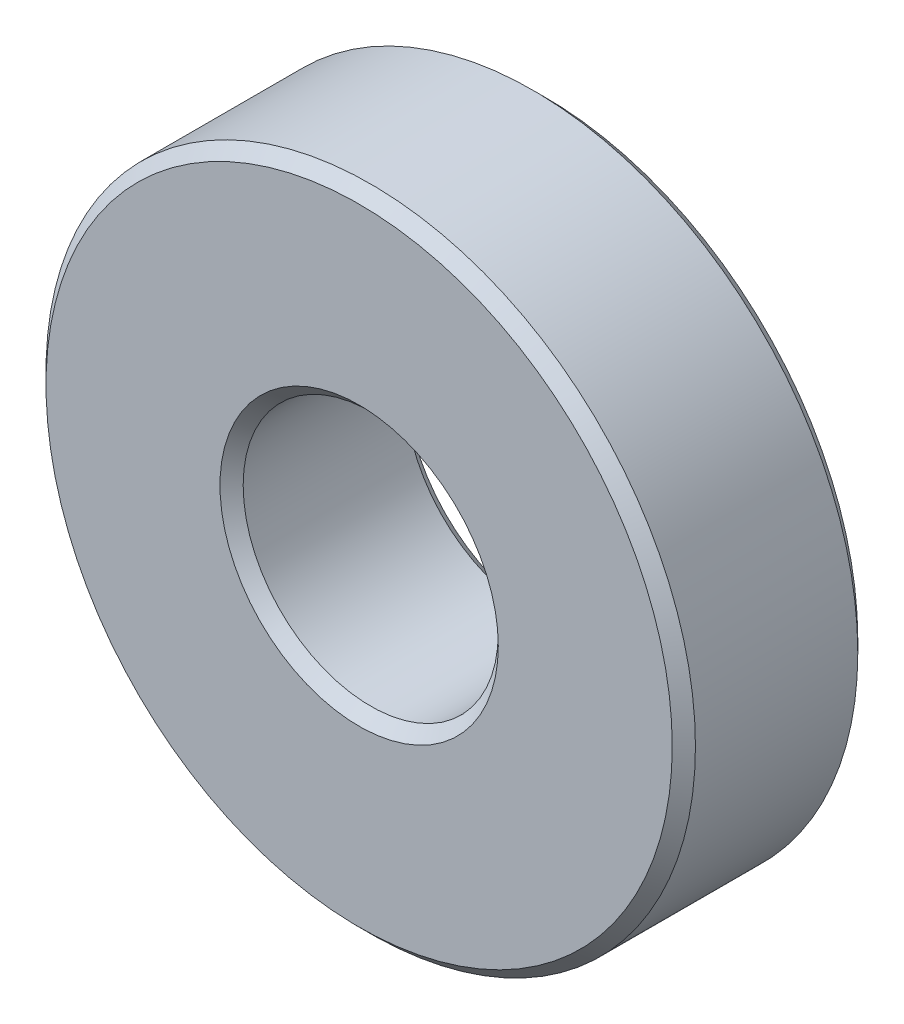
ISO-10303-21;
HEADER;
FILE_DESCRIPTION(('STEP AP214'),'2;1');
FILE_NAME('part.step','',(''),(''),'','','');
FILE_SCHEMA(('AUTOMOTIVE_DESIGN { 1 0 10303 214 1 1 1 1 }'));
ENDSEC;
DATA;
#1=APPLICATION_CONTEXT('core data for automotive mechanical design processes');
#2=APPLICATION_PROTOCOL_DEFINITION('international standard','automotive_design',2000,#1);
#3=PRODUCT_CONTEXT('',#1,'mechanical');
#4=PRODUCT('Part','Part','',(#3));
#5=PRODUCT_RELATED_PRODUCT_CATEGORY('part','',(#4));
#6=PRODUCT_DEFINITION_FORMATION('','',#4);
#7=PRODUCT_DEFINITION_CONTEXT('part definition',#1,'design');
#8=PRODUCT_DEFINITION('design','',#6,#7);
#9=PRODUCT_DEFINITION_SHAPE('','',#8);
#10=(LENGTH_UNIT() NAMED_UNIT(*) SI_UNIT(.MILLI.,.METRE.));
#11=(NAMED_UNIT(*) PLANE_ANGLE_UNIT() SI_UNIT($,.RADIAN.));
#12=(NAMED_UNIT(*) SI_UNIT($,.STERADIAN.) SOLID_ANGLE_UNIT());
#13=UNCERTAINTY_MEASURE_WITH_UNIT(LENGTH_MEASURE(1.E-05),#10,'distance_accuracy_value','');
#14=(GEOMETRIC_REPRESENTATION_CONTEXT(3) GLOBAL_UNCERTAINTY_ASSIGNED_CONTEXT((#13)) GLOBAL_UNIT_ASSIGNED_CONTEXT((#10,
#11,#12)) REPRESENTATION_CONTEXT('',''));
#15=CARTESIAN_POINT('',(0.,0.,0.));
#16=DIRECTION('',(0.,0.,1.));
#17=DIRECTION('',(1.,0.,0.));
#18=AXIS2_PLACEMENT_3D('',#15,#16,#17);
#19=CARTESIAN_POINT('',(0.,0.,8.));
#20=DIRECTION('',(0.,0.,1.));
#21=DIRECTION('',(1.,0.,0.));
#22=AXIS2_PLACEMENT_3D('',#19,#20,#21);
#23=PLANE('',#22);
#24=CARTESIAN_POINT('',(0.,0.,8.));
#25=DIRECTION('',(0.,0.,1.));
#26=DIRECTION('',(1.,0.,0.));
#27=AXIS2_PLACEMENT_3D('',#24,#25,#26);
#28=CIRCLE('',#27,6.);
#29=CARTESIAN_POINT('',(6.,0.,8.));
#30=VERTEX_POINT('',#29);
#31=EDGE_CURVE('E10',#30,#30,#28,.F.);
#32=ORIENTED_EDGE('',*,*,#31,.T.);
#33=EDGE_LOOP('',(#32));
#34=FACE_BOUND('',#33,.T.);
#35=CARTESIAN_POINT('',(0.,0.,8.));
#36=DIRECTION('',(0.,0.,1.));
#37=DIRECTION('',(1.,0.,0.));
#38=AXIS2_PLACEMENT_3D('',#35,#36,#37);
#39=CIRCLE('',#38,13.5);
#40=CARTESIAN_POINT('',(13.5,0.,8.));
#41=VERTEX_POINT('',#40);
#42=EDGE_CURVE('E47',#41,#41,#39,.T.);
#43=ORIENTED_EDGE('',*,*,#42,.T.);
#44=EDGE_LOOP('',(#43));
#45=FACE_BOUND('',#44,.T.);
#46=ADVANCED_FACE('F39',(#34,#45),#23,.T.);
#47=CARTESIAN_POINT('',(0.,0.,0.));
#48=DIRECTION('',(0.,0.,1.));
#49=DIRECTION('',(1.,0.,0.));
#50=AXIS2_PLACEMENT_3D('',#47,#48,#49);
#51=PLANE('',#50);
#52=CARTESIAN_POINT('',(0.,0.,0.));
#53=DIRECTION('',(0.,0.,1.));
#54=DIRECTION('',(1.,0.,0.));
#55=AXIS2_PLACEMENT_3D('',#52,#53,#54);
#56=CIRCLE('',#55,5.99999999999999);
#57=CARTESIAN_POINT('',(5.99999999999999,0.,0.));
#58=VERTEX_POINT('',#57);
#59=EDGE_CURVE('E66',#58,#58,#56,.T.);
#60=ORIENTED_EDGE('',*,*,#59,.T.);
#61=EDGE_LOOP('',(#60));
#62=FACE_BOUND('',#61,.T.);
#63=CARTESIAN_POINT('',(0.,0.,0.));
#64=DIRECTION('',(0.,0.,1.));
#65=DIRECTION('',(1.,0.,0.));
#66=AXIS2_PLACEMENT_3D('',#63,#64,#65);
#67=CIRCLE('',#66,13.5);
#68=CARTESIAN_POINT('',(13.5,0.,0.));
#69=VERTEX_POINT('',#68);
#70=EDGE_CURVE('E69',#69,#69,#67,.F.);
#71=ORIENTED_EDGE('',*,*,#70,.T.);
#72=EDGE_LOOP('',(#71));
#73=FACE_BOUND('',#72,.T.);
#74=ADVANCED_FACE('F73',(#62,#73),#51,.F.);
#75=CARTESIAN_POINT('',(0.,0.,8.));
#76=DIRECTION('',(0.,0.,-1.));
#77=DIRECTION('',(-1.,0.,0.));
#78=AXIS2_PLACEMENT_3D('',#75,#76,#77);
#79=CYLINDRICAL_SURFACE('',#78,14.);
#80=CARTESIAN_POINT('',(0.,0.,0.499999999999992));
#81=DIRECTION('',(0.,0.,1.));
#82=DIRECTION('',(1.,0.,0.));
#83=AXIS2_PLACEMENT_3D('',#80,#81,#82);
#84=CIRCLE('',#83,14.);
#85=CARTESIAN_POINT('',(14.,0.,0.499999999999992));
#86=VERTEX_POINT('',#85);
#87=EDGE_CURVE('E51',#86,#86,#84,.T.);
#88=ORIENTED_EDGE('',*,*,#87,.T.);
#89=EDGE_LOOP('',(#88));
#90=FACE_BOUND('',#89,.T.);
#91=CARTESIAN_POINT('',(0.,0.,7.5));
#92=DIRECTION('',(0.,0.,1.));
#93=DIRECTION('',(1.,0.,0.));
#94=AXIS2_PLACEMENT_3D('',#91,#92,#93);
#95=CIRCLE('',#94,14.);
#96=CARTESIAN_POINT('',(14.,0.,7.5));
#97=VERTEX_POINT('',#96);
#98=EDGE_CURVE('E55',#97,#97,#95,.F.);
#99=ORIENTED_EDGE('',*,*,#98,.T.);
#100=EDGE_LOOP('',(#99));
#101=FACE_BOUND('',#100,.T.);
#102=ADVANCED_FACE('F83',(#90,#101),#79,.T.);
#103=CARTESIAN_POINT('',(0.,0.,8.));
#104=DIRECTION('',(0.,0.,-1.));
#105=DIRECTION('',(-1.,0.,0.));
#106=AXIS2_PLACEMENT_3D('',#103,#104,#105);
#107=CYLINDRICAL_SURFACE('',#106,5.5);
#108=CARTESIAN_POINT('',(0.,0.,0.499999999999997));
#109=DIRECTION('',(0.,0.,1.));
#110=DIRECTION('',(1.,0.,0.));
#111=AXIS2_PLACEMENT_3D('',#108,#109,#110);
#112=CIRCLE('',#111,5.5);
#113=CARTESIAN_POINT('',(5.5,0.,0.499999999999997));
#114=VERTEX_POINT('',#113);
#115=EDGE_CURVE('E60',#114,#114,#112,.F.);
#116=ORIENTED_EDGE('',*,*,#115,.T.);
#117=EDGE_LOOP('',(#116));
#118=FACE_BOUND('',#117,.T.);
#119=CARTESIAN_POINT('',(0.,0.,7.5));
#120=DIRECTION('',(0.,0.,1.));
#121=DIRECTION('',(1.,0.,0.));
#122=AXIS2_PLACEMENT_3D('',#119,#120,#121);
#123=CIRCLE('',#122,5.5);
#124=CARTESIAN_POINT('',(5.5,0.,7.5));
#125=VERTEX_POINT('',#124);
#126=EDGE_CURVE('E63',#125,#125,#123,.T.);
#127=ORIENTED_EDGE('',*,*,#126,.T.);
#128=EDGE_LOOP('',(#127));
#129=FACE_BOUND('',#128,.T.);
#130=ADVANCED_FACE('F86',(#118,#129),#107,.F.);
#131=CARTESIAN_POINT('',(0.,0.,0.));
#132=DIRECTION('',(0.,0.,-1.));
#133=DIRECTION('',(-1.,0.,0.));
#134=AXIS2_PLACEMENT_3D('',#131,#132,#133);
#135=CONICAL_SURFACE('',#134,5.99999999999999,0.785398163397447);
#136=ORIENTED_EDGE('',*,*,#115,.F.);
#137=EDGE_LOOP('',(#136));
#138=FACE_BOUND('',#137,.T.);
#139=ORIENTED_EDGE('',*,*,#59,.F.);
#140=EDGE_LOOP('',(#139));
#141=FACE_BOUND('',#140,.T.);
#142=ADVANCED_FACE('F79',(#138,#141),#135,.F.);
#143=CARTESIAN_POINT('',(0.,0.,0.499999999999992));
#144=DIRECTION('',(0.,0.,1.));
#145=DIRECTION('',(1.,0.,0.));
#146=AXIS2_PLACEMENT_3D('',#143,#144,#145);
#147=CONICAL_SURFACE('',#146,14.,0.785398163397452);
#148=ORIENTED_EDGE('',*,*,#70,.F.);
#149=EDGE_LOOP('',(#148));
#150=FACE_BOUND('',#149,.T.);
#151=ORIENTED_EDGE('',*,*,#87,.F.);
#152=EDGE_LOOP('',(#151));
#153=FACE_BOUND('',#152,.T.);
#154=ADVANCED_FACE('F75',(#150,#153),#147,.T.);
#155=CARTESIAN_POINT('',(0.,0.,7.5));
#156=DIRECTION('',(0.,0.,1.));
#157=DIRECTION('',(1.,0.,0.));
#158=AXIS2_PLACEMENT_3D('',#155,#156,#157);
#159=CONICAL_SURFACE('',#158,5.5,0.78539816339745);
#160=ORIENTED_EDGE('',*,*,#31,.F.);
#161=EDGE_LOOP('',(#160));
#162=FACE_BOUND('',#161,.T.);
#163=ORIENTED_EDGE('',*,*,#126,.F.);
#164=EDGE_LOOP('',(#163));
#165=FACE_BOUND('',#164,.T.);
#166=ADVANCED_FACE('F78',(#162,#165),#159,.F.);
#167=CARTESIAN_POINT('',(0.,0.,8.));
#168=DIRECTION('',(0.,0.,-1.));
#169=DIRECTION('',(-1.,0.,0.));
#170=AXIS2_PLACEMENT_3D('',#167,#168,#169);
#171=CONICAL_SURFACE('',#170,13.5,0.785398163397445);
#172=ORIENTED_EDGE('',*,*,#98,.F.);
#173=EDGE_LOOP('',(#172));
#174=FACE_BOUND('',#173,.T.);
#175=ORIENTED_EDGE('',*,*,#42,.F.);
#176=EDGE_LOOP('',(#175));
#177=FACE_BOUND('',#176,.T.);
#178=ADVANCED_FACE('F42',(#174,#177),#171,.T.);
#179=CLOSED_SHELL('',(#46,#74,#102,#130,#142,#154,#166,#178));
#180=MANIFOLD_SOLID_BREP('B2',#179);
#181=ADVANCED_BREP_SHAPE_REPRESENTATION('',(#18,#180),#14);
#182=SHAPE_DEFINITION_REPRESENTATION(#9,#181);
ENDSEC;
END-ISO-10303-21;
